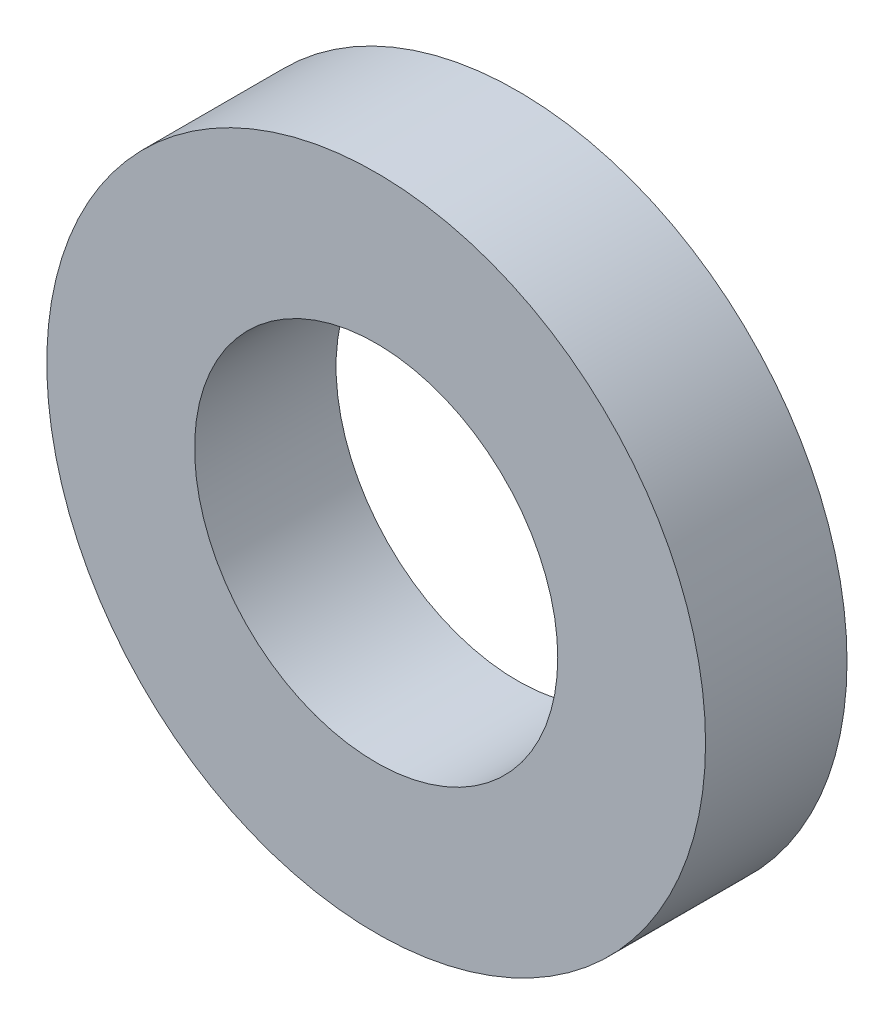
ISO-10303-21;
HEADER;
FILE_DESCRIPTION(('STEP AP214'),'2;1');
FILE_NAME('part.step','',(''),(''),'','','');
FILE_SCHEMA(('AUTOMOTIVE_DESIGN { 1 0 10303 214 1 1 1 1 }'));
ENDSEC;
DATA;
#1=APPLICATION_CONTEXT('core data for automotive mechanical design processes');
#2=APPLICATION_PROTOCOL_DEFINITION('international standard','automotive_design',2000,#1);
#3=PRODUCT_CONTEXT('',#1,'mechanical');
#4=PRODUCT('Part','Part','',(#3));
#5=PRODUCT_RELATED_PRODUCT_CATEGORY('part','',(#4));
#6=PRODUCT_DEFINITION_FORMATION('','',#4);
#7=PRODUCT_DEFINITION_CONTEXT('part definition',#1,'design');
#8=PRODUCT_DEFINITION('design','',#6,#7);
#9=PRODUCT_DEFINITION_SHAPE('','',#8);
#10=(LENGTH_UNIT() NAMED_UNIT(*) SI_UNIT(.MILLI.,.METRE.));
#11=(NAMED_UNIT(*) PLANE_ANGLE_UNIT() SI_UNIT($,.RADIAN.));
#12=(NAMED_UNIT(*) SI_UNIT($,.STERADIAN.) SOLID_ANGLE_UNIT());
#13=UNCERTAINTY_MEASURE_WITH_UNIT(LENGTH_MEASURE(1.E-05),#10,'distance_accuracy_value','');
#14=(GEOMETRIC_REPRESENTATION_CONTEXT(3) GLOBAL_UNCERTAINTY_ASSIGNED_CONTEXT((#13)) GLOBAL_UNIT_ASSIGNED_CONTEXT((#10,
#11,#12)) REPRESENTATION_CONTEXT('',''));
#15=CARTESIAN_POINT('',(0.,0.,0.));
#16=DIRECTION('',(0.,0.,1.));
#17=DIRECTION('',(1.,0.,0.));
#18=AXIS2_PLACEMENT_3D('',#15,#16,#17);
#19=CARTESIAN_POINT('',(0.,0.,-1.7018));
#20=DIRECTION('',(0.,0.,1.));
#21=DIRECTION('',(1.,0.,0.));
#22=AXIS2_PLACEMENT_3D('',#19,#20,#21);
#23=CYLINDRICAL_SURFACE('',#22,3.9624);
#24=CARTESIAN_POINT('',(0.,0.,-1.7018));
#25=DIRECTION('',(0.,0.,1.));
#26=DIRECTION('',(1.,0.,0.));
#27=AXIS2_PLACEMENT_3D('',#24,#25,#26);
#28=CIRCLE('',#27,3.9624);
#29=CARTESIAN_POINT('',(3.9624,0.,-1.7018));
#30=VERTEX_POINT('',#29);
#31=EDGE_CURVE('E10',#30,#30,#28,.T.);
#32=ORIENTED_EDGE('',*,*,#31,.T.);
#33=EDGE_LOOP('',(#32));
#34=FACE_BOUND('',#33,.T.);
#35=CARTESIAN_POINT('',(0.,0.,0.));
#36=DIRECTION('',(0.,0.,1.));
#37=DIRECTION('',(1.,0.,0.));
#38=AXIS2_PLACEMENT_3D('',#35,#36,#37);
#39=CIRCLE('',#38,3.9624);
#40=CARTESIAN_POINT('',(3.9624,0.,0.));
#41=VERTEX_POINT('',#40);
#42=EDGE_CURVE('E35',#41,#41,#39,.T.);
#43=ORIENTED_EDGE('',*,*,#42,.F.);
#44=EDGE_LOOP('',(#43));
#45=FACE_BOUND('',#44,.T.);
#46=ADVANCED_FACE('F32',(#34,#45),#23,.T.);
#47=CARTESIAN_POINT('',(0.,0.,-1.7018));
#48=DIRECTION('',(0.,0.,1.));
#49=DIRECTION('',(1.,0.,0.));
#50=AXIS2_PLACEMENT_3D('',#47,#48,#49);
#51=PLANE('',#50);
#52=CARTESIAN_POINT('',(0.,0.,-1.7018));
#53=DIRECTION('',(0.,0.,1.));
#54=DIRECTION('',(1.,0.,0.));
#55=AXIS2_PLACEMENT_3D('',#52,#53,#54);
#56=CIRCLE('',#55,2.1844);
#57=CARTESIAN_POINT('',(2.1844,0.,-1.7018));
#58=VERTEX_POINT('',#57);
#59=EDGE_CURVE('E42',#58,#58,#56,.T.);
#60=ORIENTED_EDGE('',*,*,#59,.T.);
#61=EDGE_LOOP('',(#60));
#62=FACE_BOUND('',#61,.T.);
#63=ORIENTED_EDGE('',*,*,#31,.F.);
#64=EDGE_LOOP('',(#63));
#65=FACE_BOUND('',#64,.T.);
#66=ADVANCED_FACE('F50',(#62,#65),#51,.F.);
#67=CARTESIAN_POINT('',(0.,0.,0.));
#68=DIRECTION('',(0.,0.,1.));
#69=DIRECTION('',(1.,0.,0.));
#70=AXIS2_PLACEMENT_3D('',#67,#68,#69);
#71=PLANE('',#70);
#72=CARTESIAN_POINT('',(0.,0.,0.));
#73=DIRECTION('',(0.,0.,1.));
#74=DIRECTION('',(1.,0.,0.));
#75=AXIS2_PLACEMENT_3D('',#72,#73,#74);
#76=CIRCLE('',#75,2.1844);
#77=CARTESIAN_POINT('',(2.1844,0.,0.));
#78=VERTEX_POINT('',#77);
#79=EDGE_CURVE('E44',#78,#78,#76,.T.);
#80=ORIENTED_EDGE('',*,*,#79,.F.);
#81=EDGE_LOOP('',(#80));
#82=FACE_BOUND('',#81,.T.);
#83=ORIENTED_EDGE('',*,*,#42,.T.);
#84=EDGE_LOOP('',(#83));
#85=FACE_BOUND('',#84,.T.);
#86=ADVANCED_FACE('F56',(#82,#85),#71,.T.);
#87=CARTESIAN_POINT('',(0.,0.,-1.7018));
#88=DIRECTION('',(0.,0.,1.));
#89=DIRECTION('',(1.,0.,0.));
#90=AXIS2_PLACEMENT_3D('',#87,#88,#89);
#91=CYLINDRICAL_SURFACE('',#90,2.1844);
#92=ORIENTED_EDGE('',*,*,#59,.F.);
#93=EDGE_LOOP('',(#92));
#94=FACE_BOUND('',#93,.T.);
#95=ORIENTED_EDGE('',*,*,#79,.T.);
#96=EDGE_LOOP('',(#95));
#97=FACE_BOUND('',#96,.T.);
#98=ADVANCED_FACE('F53',(#94,#97),#91,.F.);
#99=CLOSED_SHELL('',(#46,#66,#86,#98));
#100=MANIFOLD_SOLID_BREP('B2',#99);
#101=ADVANCED_BREP_SHAPE_REPRESENTATION('',(#18,#100),#14);
#102=SHAPE_DEFINITION_REPRESENTATION(#9,#101);
ENDSEC;
END-ISO-10303-21;
